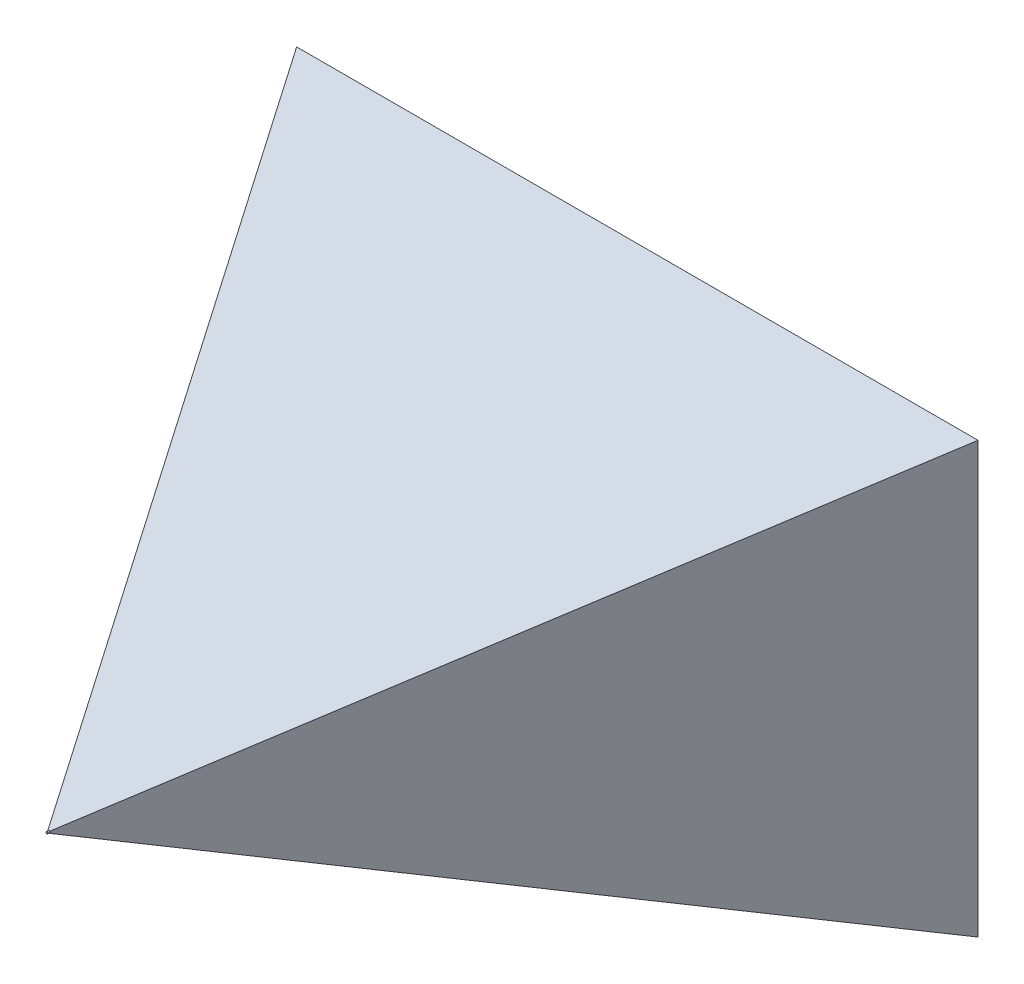
ISO-10303-21;
HEADER;
FILE_DESCRIPTION(('STEP AP214'),'2;1');
FILE_NAME('part.step','',(''),(''),'','','');
FILE_SCHEMA(('AUTOMOTIVE_DESIGN { 1 0 10303 214 1 1 1 1 }'));
ENDSEC;
DATA;
#1=APPLICATION_CONTEXT('core data for automotive mechanical design processes');
#2=APPLICATION_PROTOCOL_DEFINITION('international standard','automotive_design',2000,#1);
#3=PRODUCT_CONTEXT('',#1,'mechanical');
#4=PRODUCT('Part','Part','',(#3));
#5=PRODUCT_RELATED_PRODUCT_CATEGORY('part','',(#4));
#6=PRODUCT_DEFINITION_FORMATION('','',#4);
#7=PRODUCT_DEFINITION_CONTEXT('part definition',#1,'design');
#8=PRODUCT_DEFINITION('design','',#6,#7);
#9=PRODUCT_DEFINITION_SHAPE('','',#8);
#10=(LENGTH_UNIT() NAMED_UNIT(*) SI_UNIT(.MILLI.,.METRE.));
#11=(NAMED_UNIT(*) PLANE_ANGLE_UNIT() SI_UNIT($,.RADIAN.));
#12=(NAMED_UNIT(*) SI_UNIT($,.STERADIAN.) SOLID_ANGLE_UNIT());
#13=UNCERTAINTY_MEASURE_WITH_UNIT(LENGTH_MEASURE(1.E-05),#10,'distance_accuracy_value','');
#14=(GEOMETRIC_REPRESENTATION_CONTEXT(3) GLOBAL_UNCERTAINTY_ASSIGNED_CONTEXT((#13)) GLOBAL_UNIT_ASSIGNED_CONTEXT((#10,
#11,#12)) REPRESENTATION_CONTEXT('',''));
#15=CARTESIAN_POINT('',(0.,0.,0.));
#16=DIRECTION('',(0.,0.,1.));
#17=DIRECTION('',(1.,0.,0.));
#18=AXIS2_PLACEMENT_3D('',#15,#16,#17);
#19=CARTESIAN_POINT('',(0.,0.,600.));
#20=DIRECTION('',(0.,0.,-1.));
#21=DIRECTION('',(-1.,0.,0.));
#22=AXIS2_PLACEMENT_3D('',#19,#20,#21);
#23=PLANE('',#22);
#24=CARTESIAN_POINT('',(400.,400.,600.));
#25=DIRECTION('',(0.,0.,1.));
#26=DIRECTION('',(1.,0.,0.));
#27=AXIS2_PLACEMENT_3D('',#24,#25,#26);
#28=CIRCLE('',#27,1.00000000000005);
#29=CARTESIAN_POINT('',(401.,400.,600.));
#30=VERTEX_POINT('',#29);
#31=CARTESIAN_POINT('',(400.,401.,600.));
#32=VERTEX_POINT('',#31);
#33=EDGE_CURVE('E48',#30,#32,#28,.T.);
#34=ORIENTED_EDGE('',*,*,#33,.F.);
#35=DIRECTION('',(0.,-1.,0.));
#36=VECTOR('',#35,1.);
#37=CARTESIAN_POINT('',(401.,619.382140559717,600.));
#38=LINE('',#37,#36);
#39=CARTESIAN_POINT('',(401.,401.,600.));
#40=VERTEX_POINT('',#39);
#41=EDGE_CURVE('E93',#40,#30,#38,.T.);
#42=ORIENTED_EDGE('',*,*,#41,.F.);
#43=DIRECTION('',(1.,0.,0.));
#44=VECTOR('',#43,1.);
#45=CARTESIAN_POINT('',(0.,401.,600.));
#46=LINE('',#45,#44);
#47=EDGE_CURVE('E112',#32,#40,#46,.T.);
#48=ORIENTED_EDGE('',*,*,#47,.F.);
#49=EDGE_LOOP('',(#34,#42,#48));
#50=FACE_BOUND('',#49,.T.);
#51=ADVANCED_FACE('F37',(#50),#23,.F.);
#52=CARTESIAN_POINT('',(399.,400.,600.));
#53=VERTEX_POINT('',#52);
#54=EDGE_CURVE('E11',#32,#53,#28,.T.);
#55=ORIENTED_EDGE('',*,*,#54,.F.);
#56=CARTESIAN_POINT('',(399.,401.,600.));
#57=VERTEX_POINT('',#56);
#58=EDGE_CURVE('E130',#57,#32,#46,.T.);
#59=ORIENTED_EDGE('',*,*,#58,.F.);
#60=DIRECTION('',(0.,-1.,0.));
#61=VECTOR('',#60,1.);
#62=CARTESIAN_POINT('',(399.,619.382140559717,600.));
#63=LINE('',#62,#61);
#64=EDGE_CURVE('E110',#57,#53,#63,.T.);
#65=ORIENTED_EDGE('',*,*,#64,.T.);
#66=EDGE_LOOP('',(#55,#59,#65));
#67=FACE_BOUND('',#66,.T.);
#68=ADVANCED_FACE('F145',(#67),#23,.F.);
#69=CARTESIAN_POINT('',(400.,399.,600.));
#70=VERTEX_POINT('',#69);
#71=EDGE_CURVE('E46',#53,#70,#28,.T.);
#72=ORIENTED_EDGE('',*,*,#71,.F.);
#73=CARTESIAN_POINT('',(399.,399.,600.));
#74=VERTEX_POINT('',#73);
#75=EDGE_CURVE('E121',#53,#74,#63,.T.);
#76=ORIENTED_EDGE('',*,*,#75,.T.);
#77=DIRECTION('',(1.,0.,0.));
#78=VECTOR('',#77,1.);
#79=CARTESIAN_POINT('',(0.,399.,600.));
#80=LINE('',#79,#78);
#81=EDGE_CURVE('E133',#74,#70,#80,.T.);
#82=ORIENTED_EDGE('',*,*,#81,.T.);
#83=EDGE_LOOP('',(#72,#76,#82));
#84=FACE_BOUND('',#83,.T.);
#85=ADVANCED_FACE('F166',(#84),#23,.F.);
#86=EDGE_CURVE('E106',#70,#30,#28,.T.);
#87=ORIENTED_EDGE('',*,*,#86,.F.);
#88=CARTESIAN_POINT('',(401.,399.,600.));
#89=VERTEX_POINT('',#88);
#90=EDGE_CURVE('E108',#70,#89,#80,.T.);
#91=ORIENTED_EDGE('',*,*,#90,.T.);
#92=EDGE_CURVE('E96',#30,#89,#38,.T.);
#93=ORIENTED_EDGE('',*,*,#92,.F.);
#94=EDGE_LOOP('',(#87,#91,#93));
#95=FACE_BOUND('',#94,.T.);
#96=ADVANCED_FACE('F104',(#95),#23,.F.);
#97=CARTESIAN_POINT('',(0.,0.,0.));
#98=DIRECTION('',(0.,0.,-1.));
#99=DIRECTION('',(-1.,0.,0.));
#100=AXIS2_PLACEMENT_3D('',#97,#98,#99);
#101=PLANE('',#100);
#102=DIRECTION('',(0.,1.,0.));
#103=VECTOR('',#102,1.);
#104=CARTESIAN_POINT('',(747.410161513771,0.,0.));
#105=LINE('',#104,#103);
#106=CARTESIAN_POINT('',(747.410161513771,180.617859440283,0.));
#107=VERTEX_POINT('',#106);
#108=CARTESIAN_POINT('',(747.410161513771,619.382140559717,0.));
#109=VERTEX_POINT('',#108);
#110=EDGE_CURVE('E126',#107,#109,#105,.T.);
#111=ORIENTED_EDGE('',*,*,#110,.F.);
#112=DIRECTION('',(1.,0.,0.));
#113=VECTOR('',#112,1.);
#114=CARTESIAN_POINT('',(0.,180.617859440283,0.));
#115=LINE('',#114,#113);
#116=CARTESIAN_POINT('',(52.5898384862295,180.617859440283,0.));
#117=VERTEX_POINT('',#116);
#118=EDGE_CURVE('E132',#117,#107,#115,.T.);
#119=ORIENTED_EDGE('',*,*,#118,.F.);
#120=DIRECTION('',(0.,-1.,0.));
#121=VECTOR('',#120,1.);
#122=CARTESIAN_POINT('',(52.5898384862295,0.,0.));
#123=LINE('',#122,#121);
#124=CARTESIAN_POINT('',(52.5898384862295,619.382140559717,0.));
#125=VERTEX_POINT('',#124);
#126=EDGE_CURVE('E101',#125,#117,#123,.T.);
#127=ORIENTED_EDGE('',*,*,#126,.F.);
#128=DIRECTION('',(-1.,0.,0.));
#129=VECTOR('',#128,1.);
#130=CARTESIAN_POINT('',(0.,619.382140559717,0.));
#131=LINE('',#130,#129);
#132=EDGE_CURVE('E137',#109,#125,#131,.T.);
#133=ORIENTED_EDGE('',*,*,#132,.F.);
#134=EDGE_LOOP('',(#111,#119,#127,#133));
#135=FACE_BOUND('',#134,.T.);
#136=ADVANCED_FACE('F39',(#135),#101,.T.);
#137=CARTESIAN_POINT('',(0.,399.,600.));
#138=DIRECTION('',(0.,0.939692620785911,-0.342020143325662));
#139=DIRECTION('',(0.,0.342020143325662,0.939692620785911));
#140=AXIS2_PLACEMENT_3D('',#137,#138,#139);
#141=PLANE('',#140);
#142=ORIENTED_EDGE('',*,*,#118,.T.);
#143=DIRECTION('',(-0.47687096271147,0.300626578483217,0.82596473607056));
#144=VECTOR('',#143,1.);
#145=CARTESIAN_POINT('',(309.810228053977,456.487394445077,757.945318141133));
#146=LINE('',#145,#144);
#147=EDGE_CURVE('E128',#107,#89,#146,.T.);
#148=ORIENTED_EDGE('',*,*,#147,.T.);
#149=ORIENTED_EDGE('',*,*,#90,.F.);
#150=ORIENTED_EDGE('',*,*,#81,.F.);
#151=DIRECTION('',(-0.476870962711469,-0.300626578483217,-0.82596473607056));
#152=VECTOR('',#151,1.);
#153=CARTESIAN_POINT('',(308.265039884132,341.799325726719,442.842439056579));
#154=LINE('',#153,#152);
#155=EDGE_CURVE('E123',#74,#117,#154,.T.);
#156=ORIENTED_EDGE('',*,*,#155,.T.);
#157=EDGE_LOOP('',(#142,#148,#149,#150,#156));
#158=FACE_BOUND('',#157,.T.);
#159=ADVANCED_FACE('F173',(#158),#141,.F.);
#160=CARTESIAN_POINT('',(0.,401.,600.));
#161=DIRECTION('',(0.,-0.93969262078591,-0.342020143325663));
#162=DIRECTION('',(0.,0.342020143325663,-0.939692620785911));
#163=AXIS2_PLACEMENT_3D('',#160,#161,#162);
#164=PLANE('',#163);
#165=ORIENTED_EDGE('',*,*,#58,.T.);
#166=ORIENTED_EDGE('',*,*,#47,.T.);
#167=DIRECTION('',(0.47687096271147,0.300626578483218,-0.82596473607056));
#168=VECTOR('',#167,1.);
#169=CARTESIAN_POINT('',(309.810228053977,343.512605554923,757.945318141133));
#170=LINE('',#169,#168);
#171=EDGE_CURVE('E41',#40,#109,#170,.T.);
#172=ORIENTED_EDGE('',*,*,#171,.T.);
#173=ORIENTED_EDGE('',*,*,#132,.T.);
#174=DIRECTION('',(0.476870962711469,-0.300626578483218,0.82596473607056));
#175=VECTOR('',#174,1.);
#176=CARTESIAN_POINT('',(308.265039884132,458.200674273281,442.842439056579));
#177=LINE('',#176,#175);
#178=EDGE_CURVE('E117',#125,#57,#177,.T.);
#179=ORIENTED_EDGE('',*,*,#178,.T.);
#180=EDGE_LOOP('',(#165,#166,#172,#173,#179));
#181=FACE_BOUND('',#180,.T.);
#182=ADVANCED_FACE('F141',(#181),#164,.F.);
#183=CARTESIAN_POINT('',(0.,619.382140559717,-91.0882722199918));
#184=DIRECTION('',(0.866025403784442,0.,-0.499999999999995));
#185=DIRECTION('',(-0.499999999999995,0.,-0.866025403784442));
#186=AXIS2_PLACEMENT_3D('',#183,#184,#185);
#187=PLANE('',#186);
#188=ORIENTED_EDGE('',*,*,#64,.F.);
#189=ORIENTED_EDGE('',*,*,#178,.F.);
#190=ORIENTED_EDGE('',*,*,#126,.T.);
#191=ORIENTED_EDGE('',*,*,#155,.F.);
#192=ORIENTED_EDGE('',*,*,#75,.F.);
#193=EDGE_LOOP('',(#188,#189,#190,#191,#192));
#194=FACE_BOUND('',#193,.T.);
#195=ADVANCED_FACE('F146',(#194),#187,.F.);
#196=CARTESIAN_POINT('',(401.,619.382140559717,600.));
#197=DIRECTION('',(-0.866025403784442,0.,-0.499999999999995));
#198=DIRECTION('',(-0.499999999999995,0.,0.866025403784442));
#199=AXIS2_PLACEMENT_3D('',#196,#197,#198);
#200=PLANE('',#199);
#201=ORIENTED_EDGE('',*,*,#110,.T.);
#202=ORIENTED_EDGE('',*,*,#171,.F.);
#203=ORIENTED_EDGE('',*,*,#41,.T.);
#204=ORIENTED_EDGE('',*,*,#92,.T.);
#205=ORIENTED_EDGE('',*,*,#147,.F.);
#206=EDGE_LOOP('',(#201,#202,#203,#204,#205));
#207=FACE_BOUND('',#206,.T.);
#208=ADVANCED_FACE('F95',(#207),#200,.F.);
#209=CARTESIAN_POINT('',(400.,400.,602.));
#210=DIRECTION('',(0.,0.,-1.));
#211=DIRECTION('',(-1.,0.,0.));
#212=AXIS2_PLACEMENT_3D('',#209,#210,#211);
#213=CYLINDRICAL_SURFACE('',#212,1.00000000000005);
#214=CARTESIAN_POINT('',(400.,400.,602.));
#215=DIRECTION('',(0.,0.,1.));
#216=DIRECTION('',(1.,0.,0.));
#217=AXIS2_PLACEMENT_3D('',#214,#215,#216);
#218=CIRCLE('',#217,1.00000000000005);
#219=CARTESIAN_POINT('',(401.,400.,602.));
#220=VERTEX_POINT('',#219);
#221=EDGE_CURVE('E115',#220,#220,#218,.T.);
#222=ORIENTED_EDGE('',*,*,#221,.F.);
#223=EDGE_LOOP('',(#222));
#224=FACE_BOUND('',#223,.T.);
#225=ORIENTED_EDGE('',*,*,#33,.T.);
#226=ORIENTED_EDGE('',*,*,#54,.T.);
#227=ORIENTED_EDGE('',*,*,#71,.T.);
#228=ORIENTED_EDGE('',*,*,#86,.T.);
#229=EDGE_LOOP('',(#225,#226,#227,#228));
#230=FACE_BOUND('',#229,.T.);
#231=ADVANCED_FACE('F116',(#224,#230),#213,.T.);
#232=CARTESIAN_POINT('',(400.,400.,602.));
#233=DIRECTION('',(0.,0.,1.));
#234=DIRECTION('',(1.,0.,0.));
#235=AXIS2_PLACEMENT_3D('',#232,#233,#234);
#236=PLANE('',#235);
#237=ORIENTED_EDGE('',*,*,#221,.T.);
#238=EDGE_LOOP('',(#237));
#239=FACE_BOUND('',#238,.T.);
#240=ADVANCED_FACE('F152',(#239),#236,.T.);
#241=CLOSED_SHELL('',(#51,#68,#85,#96,#136,#159,#182,#195,#208,#231,#240));
#242=MANIFOLD_SOLID_BREP('B2',#241);
#243=ADVANCED_BREP_SHAPE_REPRESENTATION('',(#18,#242),#14);
#244=SHAPE_DEFINITION_REPRESENTATION(#9,#243);
ENDSEC;
END-ISO-10303-21;
